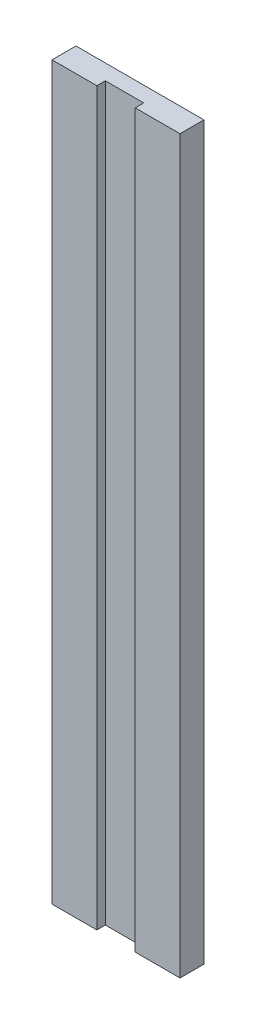
ISO-10303-21;
HEADER;
FILE_DESCRIPTION(('STEP AP214'),'2;1');
FILE_NAME('part.step','',(''),(''),'','','');
FILE_SCHEMA(('AUTOMOTIVE_DESIGN { 1 0 10303 214 1 1 1 1 }'));
ENDSEC;
DATA;
#1=APPLICATION_CONTEXT('core data for automotive mechanical design processes');
#2=APPLICATION_PROTOCOL_DEFINITION('international standard','automotive_design',2000,#1);
#3=PRODUCT_CONTEXT('',#1,'mechanical');
#4=PRODUCT('Part','Part','',(#3));
#5=PRODUCT_RELATED_PRODUCT_CATEGORY('part','',(#4));
#6=PRODUCT_DEFINITION_FORMATION('','',#4);
#7=PRODUCT_DEFINITION_CONTEXT('part definition',#1,'design');
#8=PRODUCT_DEFINITION('design','',#6,#7);
#9=PRODUCT_DEFINITION_SHAPE('','',#8);
#10=(LENGTH_UNIT() NAMED_UNIT(*) SI_UNIT(.MILLI.,.METRE.));
#11=(NAMED_UNIT(*) PLANE_ANGLE_UNIT() SI_UNIT($,.RADIAN.));
#12=(NAMED_UNIT(*) SI_UNIT($,.STERADIAN.) SOLID_ANGLE_UNIT());
#13=UNCERTAINTY_MEASURE_WITH_UNIT(LENGTH_MEASURE(1.E-05),#10,'distance_accuracy_value','');
#14=(GEOMETRIC_REPRESENTATION_CONTEXT(3) GLOBAL_UNCERTAINTY_ASSIGNED_CONTEXT((#13)) GLOBAL_UNIT_ASSIGNED_CONTEXT((#10,
#11,#12)) REPRESENTATION_CONTEXT('',''));
#15=CARTESIAN_POINT('',(0.,0.,0.));
#16=DIRECTION('',(0.,0.,1.));
#17=DIRECTION('',(1.,0.,0.));
#18=AXIS2_PLACEMENT_3D('',#15,#16,#17);
#19=CARTESIAN_POINT('',(-35.,200.,8.45));
#20=DIRECTION('',(1.,0.,0.));
#21=DIRECTION('',(0.,1.,0.));
#22=AXIS2_PLACEMENT_3D('',#19,#20,#21);
#23=PLANE('',#22);
#24=DIRECTION('',(0.,-1.,0.));
#25=VECTOR('',#24,1.);
#26=CARTESIAN_POINT('',(-35.,200.,0.));
#27=LINE('',#26,#25);
#28=CARTESIAN_POINT('',(-35.,200.,0.));
#29=VERTEX_POINT('',#28);
#30=CARTESIAN_POINT('',(-35.,-200.,0.));
#31=VERTEX_POINT('',#30);
#32=EDGE_CURVE('E165',#29,#31,#27,.T.);
#33=ORIENTED_EDGE('',*,*,#32,.T.);
#34=DIRECTION('',(0.,0.,-1.));
#35=VECTOR('',#34,1.);
#36=CARTESIAN_POINT('',(-35.,-200.,8.45));
#37=LINE('',#36,#35);
#38=CARTESIAN_POINT('',(-35.,-200.,13.1));
#39=VERTEX_POINT('',#38);
#40=EDGE_CURVE('E11',#39,#31,#37,.T.);
#41=ORIENTED_EDGE('',*,*,#40,.F.);
#42=DIRECTION('',(0.,1.,0.));
#43=VECTOR('',#42,1.);
#44=CARTESIAN_POINT('',(-35.,0.,13.1));
#45=LINE('',#44,#43);
#46=CARTESIAN_POINT('',(-35.,200.,13.1));
#47=VERTEX_POINT('',#46);
#48=EDGE_CURVE('E122',#39,#47,#45,.T.);
#49=ORIENTED_EDGE('',*,*,#48,.T.);
#50=DIRECTION('',(0.,0.,-1.));
#51=VECTOR('',#50,1.);
#52=CARTESIAN_POINT('',(-35.,200.,8.45));
#53=LINE('',#52,#51);
#54=EDGE_CURVE('E171',#47,#29,#53,.T.);
#55=ORIENTED_EDGE('',*,*,#54,.T.);
#56=EDGE_LOOP('',(#33,#41,#49,#55));
#57=FACE_BOUND('',#56,.T.);
#58=ADVANCED_FACE('F39',(#57),#23,.F.);
#59=CARTESIAN_POINT('',(35.,-200.,8.45));
#60=DIRECTION('',(0.,1.,0.));
#61=DIRECTION('',(0.,0.,1.));
#62=AXIS2_PLACEMENT_3D('',#59,#60,#61);
#63=PLANE('',#62);
#64=DIRECTION('',(1.,0.,0.));
#65=VECTOR('',#64,1.);
#66=CARTESIAN_POINT('',(35.,-200.,8.45));
#67=LINE('',#66,#65);
#68=CARTESIAN_POINT('',(-10.5,-200.,8.45));
#69=VERTEX_POINT('',#68);
#70=CARTESIAN_POINT('',(10.5,-200.,8.45));
#71=VERTEX_POINT('',#70);
#72=EDGE_CURVE('E59',#69,#71,#67,.T.);
#73=ORIENTED_EDGE('',*,*,#72,.F.);
#74=DIRECTION('',(0.,0.,-1.));
#75=VECTOR('',#74,1.);
#76=CARTESIAN_POINT('',(-10.5,-200.,13.1));
#77=LINE('',#76,#75);
#78=CARTESIAN_POINT('',(-10.5,-200.,13.1));
#79=VERTEX_POINT('',#78);
#80=EDGE_CURVE('E103',#79,#69,#77,.T.);
#81=ORIENTED_EDGE('',*,*,#80,.F.);
#82=DIRECTION('',(-1.,0.,0.));
#83=VECTOR('',#82,1.);
#84=CARTESIAN_POINT('',(0.,-200.,13.1));
#85=LINE('',#84,#83);
#86=EDGE_CURVE('E106',#79,#39,#85,.T.);
#87=ORIENTED_EDGE('',*,*,#86,.T.);
#88=ORIENTED_EDGE('',*,*,#40,.T.);
#89=DIRECTION('',(1.,0.,0.));
#90=VECTOR('',#89,1.);
#91=CARTESIAN_POINT('',(35.,-200.,0.));
#92=LINE('',#91,#90);
#93=CARTESIAN_POINT('',(35.,-200.,0.));
#94=VERTEX_POINT('',#93);
#95=EDGE_CURVE('E175',#31,#94,#92,.T.);
#96=ORIENTED_EDGE('',*,*,#95,.T.);
#97=DIRECTION('',(0.,0.,-1.));
#98=VECTOR('',#97,1.);
#99=CARTESIAN_POINT('',(35.,-200.,8.45));
#100=LINE('',#99,#98);
#101=CARTESIAN_POINT('',(35.,-200.,13.1));
#102=VERTEX_POINT('',#101);
#103=EDGE_CURVE('E47',#102,#94,#100,.T.);
#104=ORIENTED_EDGE('',*,*,#103,.F.);
#105=DIRECTION('',(-1.,0.,0.));
#106=VECTOR('',#105,1.);
#107=CARTESIAN_POINT('',(0.,-200.,13.1));
#108=LINE('',#107,#106);
#109=CARTESIAN_POINT('',(10.5,-200.,13.1));
#110=VERTEX_POINT('',#109);
#111=EDGE_CURVE('E151',#102,#110,#108,.T.);
#112=ORIENTED_EDGE('',*,*,#111,.T.);
#113=DIRECTION('',(0.,0.,-1.));
#114=VECTOR('',#113,1.);
#115=CARTESIAN_POINT('',(10.5,-200.,13.1));
#116=LINE('',#115,#114);
#117=EDGE_CURVE('E156',#110,#71,#116,.T.);
#118=ORIENTED_EDGE('',*,*,#117,.T.);
#119=EDGE_LOOP('',(#73,#81,#87,#88,#96,#104,#112,#118));
#120=FACE_BOUND('',#119,.T.);
#121=ADVANCED_FACE('F105',(#120),#63,.F.);
#122=CARTESIAN_POINT('',(35.,200.,8.45));
#123=DIRECTION('',(-1.,0.,0.));
#124=DIRECTION('',(0.,-1.,0.));
#125=AXIS2_PLACEMENT_3D('',#122,#123,#124);
#126=PLANE('',#125);
#127=DIRECTION('',(0.,1.,0.));
#128=VECTOR('',#127,1.);
#129=CARTESIAN_POINT('',(35.,200.,0.));
#130=LINE('',#129,#128);
#131=CARTESIAN_POINT('',(35.,200.,0.));
#132=VERTEX_POINT('',#131);
#133=EDGE_CURVE('E178',#94,#132,#130,.T.);
#134=ORIENTED_EDGE('',*,*,#133,.T.);
#135=DIRECTION('',(0.,0.,-1.));
#136=VECTOR('',#135,1.);
#137=CARTESIAN_POINT('',(35.,200.,8.45));
#138=LINE('',#137,#136);
#139=CARTESIAN_POINT('',(35.,200.,13.1));
#140=VERTEX_POINT('',#139);
#141=EDGE_CURVE('E186',#140,#132,#138,.T.);
#142=ORIENTED_EDGE('',*,*,#141,.F.);
#143=DIRECTION('',(0.,-1.,0.));
#144=VECTOR('',#143,1.);
#145=CARTESIAN_POINT('',(35.,0.,13.1));
#146=LINE('',#145,#144);
#147=EDGE_CURVE('E147',#140,#102,#146,.T.);
#148=ORIENTED_EDGE('',*,*,#147,.T.);
#149=ORIENTED_EDGE('',*,*,#103,.T.);
#150=EDGE_LOOP('',(#134,#142,#148,#149));
#151=FACE_BOUND('',#150,.T.);
#152=ADVANCED_FACE('F193',(#151),#126,.F.);
#153=CARTESIAN_POINT('',(35.,200.,8.45));
#154=DIRECTION('',(0.,-1.,0.));
#155=DIRECTION('',(0.,0.,-1.));
#156=AXIS2_PLACEMENT_3D('',#153,#154,#155);
#157=PLANE('',#156);
#158=DIRECTION('',(-1.,0.,0.));
#159=VECTOR('',#158,1.);
#160=CARTESIAN_POINT('',(35.,200.,0.));
#161=LINE('',#160,#159);
#162=EDGE_CURVE('E168',#132,#29,#161,.T.);
#163=ORIENTED_EDGE('',*,*,#162,.T.);
#164=ORIENTED_EDGE('',*,*,#54,.F.);
#165=DIRECTION('',(1.,0.,0.));
#166=VECTOR('',#165,1.);
#167=CARTESIAN_POINT('',(0.,200.,13.1));
#168=LINE('',#167,#166);
#169=CARTESIAN_POINT('',(-10.5,200.,13.1));
#170=VERTEX_POINT('',#169);
#171=EDGE_CURVE('E112',#47,#170,#168,.T.);
#172=ORIENTED_EDGE('',*,*,#171,.T.);
#173=DIRECTION('',(0.,0.,-1.));
#174=VECTOR('',#173,1.);
#175=CARTESIAN_POINT('',(-10.5,200.,13.1));
#176=LINE('',#175,#174);
#177=CARTESIAN_POINT('',(-10.5,200.,8.45));
#178=VERTEX_POINT('',#177);
#179=EDGE_CURVE('E111',#170,#178,#176,.T.);
#180=ORIENTED_EDGE('',*,*,#179,.T.);
#181=DIRECTION('',(-1.,0.,0.));
#182=VECTOR('',#181,1.);
#183=CARTESIAN_POINT('',(35.,200.,8.45));
#184=LINE('',#183,#182);
#185=CARTESIAN_POINT('',(10.5,200.,8.45));
#186=VERTEX_POINT('',#185);
#187=EDGE_CURVE('E54',#186,#178,#184,.T.);
#188=ORIENTED_EDGE('',*,*,#187,.F.);
#189=DIRECTION('',(0.,0.,-1.));
#190=VECTOR('',#189,1.);
#191=CARTESIAN_POINT('',(10.5,200.,13.1));
#192=LINE('',#191,#190);
#193=CARTESIAN_POINT('',(10.5,200.,13.1));
#194=VERTEX_POINT('',#193);
#195=EDGE_CURVE('E155',#194,#186,#192,.T.);
#196=ORIENTED_EDGE('',*,*,#195,.F.);
#197=DIRECTION('',(1.,0.,0.));
#198=VECTOR('',#197,1.);
#199=CARTESIAN_POINT('',(0.,200.,13.1));
#200=LINE('',#199,#198);
#201=EDGE_CURVE('E143',#194,#140,#200,.T.);
#202=ORIENTED_EDGE('',*,*,#201,.T.);
#203=ORIENTED_EDGE('',*,*,#141,.T.);
#204=EDGE_LOOP('',(#163,#164,#172,#180,#188,#196,#202,#203));
#205=FACE_BOUND('',#204,.T.);
#206=ADVANCED_FACE('F201',(#205),#157,.F.);
#207=CARTESIAN_POINT('',(0.,0.,8.45));
#208=DIRECTION('',(0.,0.,-1.));
#209=DIRECTION('',(-1.,0.,0.));
#210=AXIS2_PLACEMENT_3D('',#207,#208,#209);
#211=PLANE('',#210);
#212=ORIENTED_EDGE('',*,*,#187,.T.);
#213=DIRECTION('',(0.,-1.,0.));
#214=VECTOR('',#213,1.);
#215=CARTESIAN_POINT('',(-10.5,0.,8.45));
#216=LINE('',#215,#214);
#217=EDGE_CURVE('E135',#178,#69,#216,.T.);
#218=ORIENTED_EDGE('',*,*,#217,.T.);
#219=ORIENTED_EDGE('',*,*,#72,.T.);
#220=DIRECTION('',(0.,1.,0.));
#221=VECTOR('',#220,1.);
#222=CARTESIAN_POINT('',(10.5,0.,8.45));
#223=LINE('',#222,#221);
#224=EDGE_CURVE('E159',#71,#186,#223,.T.);
#225=ORIENTED_EDGE('',*,*,#224,.T.);
#226=EDGE_LOOP('',(#212,#218,#219,#225));
#227=FACE_BOUND('',#226,.T.);
#228=ADVANCED_FACE('F204',(#227),#211,.F.);
#229=CARTESIAN_POINT('',(0.,0.,0.));
#230=DIRECTION('',(0.,0.,-1.));
#231=DIRECTION('',(-1.,0.,0.));
#232=AXIS2_PLACEMENT_3D('',#229,#230,#231);
#233=PLANE('',#232);
#234=ORIENTED_EDGE('',*,*,#133,.F.);
#235=ORIENTED_EDGE('',*,*,#95,.F.);
#236=ORIENTED_EDGE('',*,*,#32,.F.);
#237=ORIENTED_EDGE('',*,*,#162,.F.);
#238=EDGE_LOOP('',(#234,#235,#236,#237));
#239=FACE_BOUND('',#238,.T.);
#240=ADVANCED_FACE('F198',(#239),#233,.T.);
#241=CARTESIAN_POINT('',(10.5,0.,13.1));
#242=DIRECTION('',(-1.,0.,0.));
#243=DIRECTION('',(0.,-1.,0.));
#244=AXIS2_PLACEMENT_3D('',#241,#242,#243);
#245=PLANE('',#244);
#246=ORIENTED_EDGE('',*,*,#224,.F.);
#247=ORIENTED_EDGE('',*,*,#117,.F.);
#248=DIRECTION('',(0.,1.,0.));
#249=VECTOR('',#248,1.);
#250=CARTESIAN_POINT('',(10.5,0.,13.1));
#251=LINE('',#250,#249);
#252=EDGE_CURVE('E139',#110,#194,#251,.T.);
#253=ORIENTED_EDGE('',*,*,#252,.T.);
#254=ORIENTED_EDGE('',*,*,#195,.T.);
#255=EDGE_LOOP('',(#246,#247,#253,#254));
#256=FACE_BOUND('',#255,.T.);
#257=ADVANCED_FACE('F206',(#256),#245,.T.);
#258=CARTESIAN_POINT('',(0.,0.,13.1));
#259=DIRECTION('',(0.,0.,-1.));
#260=DIRECTION('',(-1.,0.,0.));
#261=AXIS2_PLACEMENT_3D('',#258,#259,#260);
#262=PLANE('',#261);
#263=ORIENTED_EDGE('',*,*,#252,.F.);
#264=ORIENTED_EDGE('',*,*,#111,.F.);
#265=ORIENTED_EDGE('',*,*,#147,.F.);
#266=ORIENTED_EDGE('',*,*,#201,.F.);
#267=EDGE_LOOP('',(#263,#264,#265,#266));
#268=FACE_BOUND('',#267,.T.);
#269=ADVANCED_FACE('F209',(#268),#262,.F.);
#270=CARTESIAN_POINT('',(-10.5,0.,13.1));
#271=DIRECTION('',(1.,0.,0.));
#272=DIRECTION('',(0.,1.,0.));
#273=AXIS2_PLACEMENT_3D('',#270,#271,#272);
#274=PLANE('',#273);
#275=ORIENTED_EDGE('',*,*,#217,.F.);
#276=ORIENTED_EDGE('',*,*,#179,.F.);
#277=DIRECTION('',(0.,-1.,0.));
#278=VECTOR('',#277,1.);
#279=CARTESIAN_POINT('',(-10.5,0.,13.1));
#280=LINE('',#279,#278);
#281=EDGE_CURVE('E119',#170,#79,#280,.T.);
#282=ORIENTED_EDGE('',*,*,#281,.T.);
#283=ORIENTED_EDGE('',*,*,#80,.T.);
#284=EDGE_LOOP('',(#275,#276,#282,#283));
#285=FACE_BOUND('',#284,.T.);
#286=ADVANCED_FACE('F125',(#285),#274,.T.);
#287=CARTESIAN_POINT('',(0.,0.,13.1));
#288=DIRECTION('',(0.,0.,-1.));
#289=DIRECTION('',(-1.,0.,0.));
#290=AXIS2_PLACEMENT_3D('',#287,#288,#289);
#291=PLANE('',#290);
#292=ORIENTED_EDGE('',*,*,#281,.F.);
#293=ORIENTED_EDGE('',*,*,#171,.F.);
#294=ORIENTED_EDGE('',*,*,#48,.F.);
#295=ORIENTED_EDGE('',*,*,#86,.F.);
#296=EDGE_LOOP('',(#292,#293,#294,#295));
#297=FACE_BOUND('',#296,.T.);
#298=ADVANCED_FACE('F117',(#297),#291,.F.);
#299=CLOSED_SHELL('',(#58,#121,#152,#206,#228,#240,#257,#269,#286,#298));
#300=MANIFOLD_SOLID_BREP('B2',#299);
#301=ADVANCED_BREP_SHAPE_REPRESENTATION('',(#18,#300),#14);
#302=SHAPE_DEFINITION_REPRESENTATION(#9,#301);
ENDSEC;
END-ISO-10303-21;
